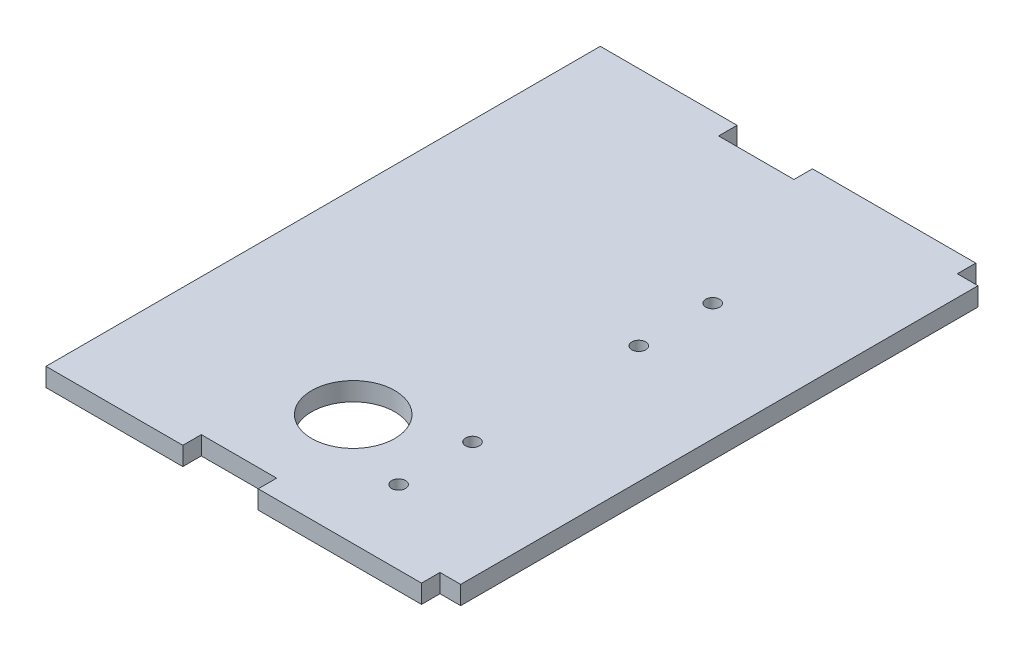
ISO-10303-21;
HEADER;
FILE_DESCRIPTION(('STEP AP214'),'2;1');
FILE_NAME('part.step','',(''),(''),'','','');
FILE_SCHEMA(('AUTOMOTIVE_DESIGN { 1 0 10303 214 1 1 1 1 }'));
ENDSEC;
DATA;
#1=APPLICATION_CONTEXT('core data for automotive mechanical design processes');
#2=APPLICATION_PROTOCOL_DEFINITION('international standard','automotive_design',2000,#1);
#3=PRODUCT_CONTEXT('',#1,'mechanical');
#4=PRODUCT('Part','Part','',(#3));
#5=PRODUCT_RELATED_PRODUCT_CATEGORY('part','',(#4));
#6=PRODUCT_DEFINITION_FORMATION('','',#4);
#7=PRODUCT_DEFINITION_CONTEXT('part definition',#1,'design');
#8=PRODUCT_DEFINITION('design','',#6,#7);
#9=PRODUCT_DEFINITION_SHAPE('','',#8);
#10=(LENGTH_UNIT() NAMED_UNIT(*) SI_UNIT(.MILLI.,.METRE.));
#11=(NAMED_UNIT(*) PLANE_ANGLE_UNIT() SI_UNIT($,.RADIAN.));
#12=(NAMED_UNIT(*) SI_UNIT($,.STERADIAN.) SOLID_ANGLE_UNIT());
#13=UNCERTAINTY_MEASURE_WITH_UNIT(LENGTH_MEASURE(1.E-05),#10,'distance_accuracy_value','');
#14=(GEOMETRIC_REPRESENTATION_CONTEXT(3) GLOBAL_UNCERTAINTY_ASSIGNED_CONTEXT((#13)) GLOBAL_UNIT_ASSIGNED_CONTEXT((#10,
#11,#12)) REPRESENTATION_CONTEXT('',''));
#15=CARTESIAN_POINT('',(0.,0.,0.));
#16=DIRECTION('',(0.,0.,1.));
#17=DIRECTION('',(1.,0.,0.));
#18=AXIS2_PLACEMENT_3D('',#15,#16,#17);
#19=CARTESIAN_POINT('',(0.,12.7,0.));
#20=DIRECTION('',(0.,0.,-1.));
#21=DIRECTION('',(-1.,0.,0.));
#22=AXIS2_PLACEMENT_3D('',#19,#20,#21);
#23=PLANE('',#22);
#24=DIRECTION('',(0.,1.,0.));
#25=VECTOR('',#24,1.);
#26=CARTESIAN_POINT('',(290.576,0.,0.));
#27=LINE('',#26,#25);
#28=CARTESIAN_POINT('',(290.576,0.,0.));
#29=VERTEX_POINT('',#28);
#30=CARTESIAN_POINT('',(290.576,12.7,0.));
#31=VERTEX_POINT('',#30);
#32=EDGE_CURVE('E270',#29,#31,#27,.T.);
#33=ORIENTED_EDGE('',*,*,#32,.F.);
#34=DIRECTION('',(1.,0.,0.));
#35=VECTOR('',#34,1.);
#36=CARTESIAN_POINT('',(0.,0.,0.));
#37=LINE('',#36,#35);
#38=CARTESIAN_POINT('',(304.8,0.,0.));
#39=VERTEX_POINT('',#38);
#40=EDGE_CURVE('E234',#29,#39,#37,.T.);
#41=ORIENTED_EDGE('',*,*,#40,.T.);
#42=DIRECTION('',(0.,-1.,0.));
#43=VECTOR('',#42,1.);
#44=CARTESIAN_POINT('',(304.8,12.7,0.));
#45=LINE('',#44,#43);
#46=CARTESIAN_POINT('',(304.8,12.7,0.));
#47=VERTEX_POINT('',#46);
#48=EDGE_CURVE('E11',#47,#39,#45,.T.);
#49=ORIENTED_EDGE('',*,*,#48,.F.);
#50=DIRECTION('',(1.,0.,0.));
#51=VECTOR('',#50,1.);
#52=CARTESIAN_POINT('',(0.,12.7,0.));
#53=LINE('',#52,#51);
#54=EDGE_CURVE('E273',#31,#47,#53,.T.);
#55=ORIENTED_EDGE('',*,*,#54,.F.);
#56=EDGE_LOOP('',(#33,#41,#49,#55));
#57=FACE_BOUND('',#56,.T.);
#58=ADVANCED_FACE('F43',(#57),#23,.F.);
#59=CARTESIAN_POINT('',(0.,12.7,-355.6));
#60=DIRECTION('',(0.,0.,1.));
#61=DIRECTION('',(1.,0.,0.));
#62=AXIS2_PLACEMENT_3D('',#59,#60,#61);
#63=PLANE('',#62);
#64=DIRECTION('',(-1.,0.,0.));
#65=VECTOR('',#64,1.);
#66=CARTESIAN_POINT('',(0.,0.,-355.6));
#67=LINE('',#66,#65);
#68=CARTESIAN_POINT('',(304.8,0.,-355.6));
#69=VERTEX_POINT('',#68);
#70=CARTESIAN_POINT('',(290.576,0.,-355.6));
#71=VERTEX_POINT('',#70);
#72=EDGE_CURVE('E299',#69,#71,#67,.T.);
#73=ORIENTED_EDGE('',*,*,#72,.T.);
#74=DIRECTION('',(0.,1.,0.));
#75=VECTOR('',#74,1.);
#76=CARTESIAN_POINT('',(290.576,0.,-355.6));
#77=LINE('',#76,#75);
#78=CARTESIAN_POINT('',(290.576,12.7,-355.6));
#79=VERTEX_POINT('',#78);
#80=EDGE_CURVE('E324',#71,#79,#77,.T.);
#81=ORIENTED_EDGE('',*,*,#80,.T.);
#82=DIRECTION('',(-1.,0.,0.));
#83=VECTOR('',#82,1.);
#84=CARTESIAN_POINT('',(0.,12.7,-355.6));
#85=LINE('',#84,#83);
#86=CARTESIAN_POINT('',(304.8,12.7,-355.6));
#87=VERTEX_POINT('',#86);
#88=EDGE_CURVE('E294',#87,#79,#85,.T.);
#89=ORIENTED_EDGE('',*,*,#88,.F.);
#90=DIRECTION('',(0.,-1.,0.));
#91=VECTOR('',#90,1.);
#92=CARTESIAN_POINT('',(304.8,12.7,-355.6));
#93=LINE('',#92,#91);
#94=EDGE_CURVE('E52',#87,#69,#93,.T.);
#95=ORIENTED_EDGE('',*,*,#94,.T.);
#96=EDGE_LOOP('',(#73,#81,#89,#95));
#97=FACE_BOUND('',#96,.T.);
#98=ADVANCED_FACE('F248',(#97),#63,.F.);
#99=CARTESIAN_POINT('',(0.,12.7,0.));
#100=DIRECTION('',(0.,-1.,0.));
#101=DIRECTION('',(0.,0.,-1.));
#102=AXIS2_PLACEMENT_3D('',#99,#100,#101);
#103=PLANE('',#102);
#104=CARTESIAN_POINT('',(224.028,12.7,-38.1));
#105=DIRECTION('',(0.,-1.,0.));
#106=DIRECTION('',(0.,0.,-1.));
#107=AXIS2_PLACEMENT_3D('',#104,#105,#106);
#108=CIRCLE('',#107,4.76250000000001);
#109=CARTESIAN_POINT('',(224.028,12.7,-42.8625));
#110=VERTEX_POINT('',#109);
#111=EDGE_CURVE('E197',#110,#110,#108,.T.);
#112=ORIENTED_EDGE('',*,*,#111,.T.);
#113=EDGE_LOOP('',(#112));
#114=FACE_BOUND('',#113,.T.);
#115=CARTESIAN_POINT('',(224.028,12.7,-88.9));
#116=DIRECTION('',(0.,-1.,0.));
#117=DIRECTION('',(0.,0.,-1.));
#118=AXIS2_PLACEMENT_3D('',#115,#116,#117);
#119=CIRCLE('',#118,4.76250000000001);
#120=CARTESIAN_POINT('',(224.028,12.7,-93.6625));
#121=VERTEX_POINT('',#120);
#122=EDGE_CURVE('E210',#121,#121,#119,.T.);
#123=ORIENTED_EDGE('',*,*,#122,.T.);
#124=EDGE_LOOP('',(#123));
#125=FACE_BOUND('',#124,.T.);
#126=CARTESIAN_POINT('',(224.028,12.7,-203.2));
#127=DIRECTION('',(0.,-1.,0.));
#128=DIRECTION('',(0.,0.,-1.));
#129=AXIS2_PLACEMENT_3D('',#126,#127,#128);
#130=CIRCLE('',#129,4.76250000000001);
#131=CARTESIAN_POINT('',(224.028,12.7,-207.9625));
#132=VERTEX_POINT('',#131);
#133=EDGE_CURVE('E218',#132,#132,#130,.T.);
#134=ORIENTED_EDGE('',*,*,#133,.T.);
#135=EDGE_LOOP('',(#134));
#136=FACE_BOUND('',#135,.T.);
#137=CARTESIAN_POINT('',(224.028,12.7,-254.));
#138=DIRECTION('',(0.,-1.,0.));
#139=DIRECTION('',(0.,0.,-1.));
#140=AXIS2_PLACEMENT_3D('',#137,#138,#139);
#141=CIRCLE('',#140,4.76250000000001);
#142=CARTESIAN_POINT('',(224.028,12.7,-258.7625));
#143=VERTEX_POINT('',#142);
#144=EDGE_CURVE('E192',#143,#143,#141,.T.);
#145=ORIENTED_EDGE('',*,*,#144,.T.);
#146=EDGE_LOOP('',(#145));
#147=FACE_BOUND('',#146,.T.);
#148=DIRECTION('',(-1.,0.,0.));
#149=VECTOR('',#148,1.);
#150=CARTESIAN_POINT('',(14.224,12.7,-368.3));
#151=LINE('',#150,#149);
#152=CARTESIAN_POINT('',(126.492,12.7,-368.3));
#153=VERTEX_POINT('',#152);
#154=CARTESIAN_POINT('',(32.4508751450575,12.7,-368.3));
#155=VERTEX_POINT('',#154);
#156=EDGE_CURVE('E168',#153,#155,#151,.T.);
#157=ORIENTED_EDGE('',*,*,#156,.T.);
#158=DIRECTION('',(0.,0.,1.));
#159=VECTOR('',#158,1.);
#160=CARTESIAN_POINT('',(32.4508751450575,12.7,-368.3));
#161=LINE('',#160,#159);
#162=CARTESIAN_POINT('',(32.4508751450575,12.7,12.7));
#163=VERTEX_POINT('',#162);
#164=EDGE_CURVE('E155',#155,#163,#161,.T.);
#165=ORIENTED_EDGE('',*,*,#164,.T.);
#166=DIRECTION('',(1.,0.,0.));
#167=VECTOR('',#166,1.);
#168=CARTESIAN_POINT('',(14.2240000000001,12.7,12.7));
#169=LINE('',#168,#167);
#170=CARTESIAN_POINT('',(126.492,12.7,12.6999999999999));
#171=VERTEX_POINT('',#170);
#172=EDGE_CURVE('E279',#163,#171,#169,.T.);
#173=ORIENTED_EDGE('',*,*,#172,.T.);
#174=DIRECTION('',(0.,0.,-1.));
#175=VECTOR('',#174,1.);
#176=CARTESIAN_POINT('',(126.492,12.7,0.));
#177=LINE('',#176,#175);
#178=CARTESIAN_POINT('',(126.492,12.7,0.));
#179=VERTEX_POINT('',#178);
#180=EDGE_CURVE('E67',#171,#179,#177,.T.);
#181=ORIENTED_EDGE('',*,*,#180,.T.);
#182=CARTESIAN_POINT('',(178.308,12.7,0.));
#183=VERTEX_POINT('',#182);
#184=EDGE_CURVE('E314',#179,#183,#53,.T.);
#185=ORIENTED_EDGE('',*,*,#184,.T.);
#186=DIRECTION('',(0.,0.,1.));
#187=VECTOR('',#186,1.);
#188=CARTESIAN_POINT('',(178.308,12.7,0.));
#189=LINE('',#188,#187);
#190=CARTESIAN_POINT('',(178.308,12.7,12.6999999999999));
#191=VERTEX_POINT('',#190);
#192=EDGE_CURVE('E330',#183,#191,#189,.T.);
#193=ORIENTED_EDGE('',*,*,#192,.T.);
#194=DIRECTION('',(1.,0.,0.));
#195=VECTOR('',#194,1.);
#196=CARTESIAN_POINT('',(290.576,12.7,12.7));
#197=LINE('',#196,#195);
#198=CARTESIAN_POINT('',(290.576,12.7,12.7));
#199=VERTEX_POINT('',#198);
#200=EDGE_CURVE('E337',#191,#199,#197,.T.);
#201=ORIENTED_EDGE('',*,*,#200,.T.);
#202=DIRECTION('',(0.,0.,-1.));
#203=VECTOR('',#202,1.);
#204=CARTESIAN_POINT('',(290.576,12.7,0.));
#205=LINE('',#204,#203);
#206=EDGE_CURVE('E322',#199,#31,#205,.T.);
#207=ORIENTED_EDGE('',*,*,#206,.T.);
#208=ORIENTED_EDGE('',*,*,#54,.T.);
#209=DIRECTION('',(0.,0.,-1.));
#210=VECTOR('',#209,1.);
#211=CARTESIAN_POINT('',(304.8,12.7,0.));
#212=LINE('',#211,#210);
#213=EDGE_CURVE('E311',#47,#87,#212,.T.);
#214=ORIENTED_EDGE('',*,*,#213,.T.);
#215=ORIENTED_EDGE('',*,*,#88,.T.);
#216=DIRECTION('',(0.,0.,-1.));
#217=VECTOR('',#216,1.);
#218=CARTESIAN_POINT('',(290.576,12.7,-355.6));
#219=LINE('',#218,#217);
#220=CARTESIAN_POINT('',(290.576,12.7,-368.3));
#221=VERTEX_POINT('',#220);
#222=EDGE_CURVE('E185',#79,#221,#219,.T.);
#223=ORIENTED_EDGE('',*,*,#222,.T.);
#224=DIRECTION('',(-1.,0.,0.));
#225=VECTOR('',#224,1.);
#226=CARTESIAN_POINT('',(290.576,12.7,-368.3));
#227=LINE('',#226,#225);
#228=CARTESIAN_POINT('',(178.308,12.7,-368.3));
#229=VERTEX_POINT('',#228);
#230=EDGE_CURVE('E344',#221,#229,#227,.T.);
#231=ORIENTED_EDGE('',*,*,#230,.T.);
#232=DIRECTION('',(0.,0.,1.));
#233=VECTOR('',#232,1.);
#234=CARTESIAN_POINT('',(178.308,12.7,-355.6));
#235=LINE('',#234,#233);
#236=CARTESIAN_POINT('',(178.308,12.7,-355.6));
#237=VERTEX_POINT('',#236);
#238=EDGE_CURVE('E341',#229,#237,#235,.T.);
#239=ORIENTED_EDGE('',*,*,#238,.T.);
#240=CARTESIAN_POINT('',(126.492,12.7,-355.6));
#241=VERTEX_POINT('',#240);
#242=EDGE_CURVE('E308',#237,#241,#85,.T.);
#243=ORIENTED_EDGE('',*,*,#242,.T.);
#244=DIRECTION('',(0.,0.,-1.));
#245=VECTOR('',#244,1.);
#246=CARTESIAN_POINT('',(126.492,12.7,-355.6));
#247=LINE('',#246,#245);
#248=EDGE_CURVE('E177',#241,#153,#247,.T.);
#249=ORIENTED_EDGE('',*,*,#248,.T.);
#250=EDGE_LOOP('',(#157,#165,#173,#181,#185,#193,#201,#207,#208,#214,#215,#223,#231,#239,#243,#249));
#251=FACE_BOUND('',#250,.T.);
#252=CARTESIAN_POINT('',(166.724174941641,12.7,-64.1950036756181));
#253=DIRECTION('',(0.,1.,0.));
#254=DIRECTION('',(1.,0.,0.));
#255=AXIS2_PLACEMENT_3D('',#252,#253,#254);
#256=ELLIPSE('',#255,28.575,28.5739911525185);
#257=CARTESIAN_POINT('',(195.299174941641,12.7,-64.1950036756185));
#258=VERTEX_POINT('',#257);
#259=EDGE_CURVE('E229',#258,#258,#256,.T.);
#260=ORIENTED_EDGE('',*,*,#259,.F.);
#261=EDGE_LOOP('',(#260));
#262=FACE_BOUND('',#261,.T.);
#263=ADVANCED_FACE('F174',(#114,#125,#136,#147,#251,#262),#103,.F.);
#264=CARTESIAN_POINT('',(0.,0.,0.));
#265=DIRECTION('',(0.,-1.,0.));
#266=DIRECTION('',(0.,0.,-1.));
#267=AXIS2_PLACEMENT_3D('',#264,#265,#266);
#268=PLANE('',#267);
#269=DIRECTION('',(0.,0.,1.));
#270=VECTOR('',#269,1.);
#271=CARTESIAN_POINT('',(32.4508751450575,0.,-368.3));
#272=LINE('',#271,#270);
#273=CARTESIAN_POINT('',(32.4508751450575,0.,-368.3));
#274=VERTEX_POINT('',#273);
#275=CARTESIAN_POINT('',(32.4508751450575,0.,12.7));
#276=VERTEX_POINT('',#275);
#277=EDGE_CURVE('E59',#274,#276,#272,.T.);
#278=ORIENTED_EDGE('',*,*,#277,.F.);
#279=DIRECTION('',(-1.,0.,0.));
#280=VECTOR('',#279,1.);
#281=CARTESIAN_POINT('',(14.224,0.,-368.3));
#282=LINE('',#281,#280);
#283=CARTESIAN_POINT('',(126.492,0.,-368.3));
#284=VERTEX_POINT('',#283);
#285=EDGE_CURVE('E170',#284,#274,#282,.T.);
#286=ORIENTED_EDGE('',*,*,#285,.F.);
#287=DIRECTION('',(0.,0.,-1.));
#288=VECTOR('',#287,1.);
#289=CARTESIAN_POINT('',(126.492,0.,-355.6));
#290=LINE('',#289,#288);
#291=CARTESIAN_POINT('',(126.492,0.,-355.6));
#292=VERTEX_POINT('',#291);
#293=EDGE_CURVE('E179',#292,#284,#290,.T.);
#294=ORIENTED_EDGE('',*,*,#293,.F.);
#295=CARTESIAN_POINT('',(178.308,0.,-355.6));
#296=VERTEX_POINT('',#295);
#297=EDGE_CURVE('E298',#296,#292,#67,.T.);
#298=ORIENTED_EDGE('',*,*,#297,.F.);
#299=DIRECTION('',(0.,0.,1.));
#300=VECTOR('',#299,1.);
#301=CARTESIAN_POINT('',(178.308,0.,-355.6));
#302=LINE('',#301,#300);
#303=CARTESIAN_POINT('',(178.308,0.,-368.3));
#304=VERTEX_POINT('',#303);
#305=EDGE_CURVE('E351',#304,#296,#302,.T.);
#306=ORIENTED_EDGE('',*,*,#305,.F.);
#307=DIRECTION('',(-1.,0.,0.));
#308=VECTOR('',#307,1.);
#309=CARTESIAN_POINT('',(290.576,0.,-368.3));
#310=LINE('',#309,#308);
#311=CARTESIAN_POINT('',(290.576,0.,-368.3));
#312=VERTEX_POINT('',#311);
#313=EDGE_CURVE('E354',#312,#304,#310,.T.);
#314=ORIENTED_EDGE('',*,*,#313,.F.);
#315=DIRECTION('',(0.,0.,-1.));
#316=VECTOR('',#315,1.);
#317=CARTESIAN_POINT('',(290.576,0.,-355.6));
#318=LINE('',#317,#316);
#319=EDGE_CURVE('E345',#71,#312,#318,.T.);
#320=ORIENTED_EDGE('',*,*,#319,.F.);
#321=ORIENTED_EDGE('',*,*,#72,.F.);
#322=DIRECTION('',(0.,0.,-1.));
#323=VECTOR('',#322,1.);
#324=CARTESIAN_POINT('',(304.8,0.,0.));
#325=LINE('',#324,#323);
#326=EDGE_CURVE('E287',#39,#69,#325,.T.);
#327=ORIENTED_EDGE('',*,*,#326,.F.);
#328=ORIENTED_EDGE('',*,*,#40,.F.);
#329=DIRECTION('',(0.,0.,-1.));
#330=VECTOR('',#329,1.);
#331=CARTESIAN_POINT('',(290.576,0.,0.));
#332=LINE('',#331,#330);
#333=CARTESIAN_POINT('',(290.576,0.,12.7));
#334=VERTEX_POINT('',#333);
#335=EDGE_CURVE('E285',#334,#29,#332,.T.);
#336=ORIENTED_EDGE('',*,*,#335,.F.);
#337=DIRECTION('',(1.,0.,0.));
#338=VECTOR('',#337,1.);
#339=CARTESIAN_POINT('',(290.576,0.,12.7));
#340=LINE('',#339,#338);
#341=CARTESIAN_POINT('',(178.308,0.,12.6999999999999));
#342=VERTEX_POINT('',#341);
#343=EDGE_CURVE('E382',#342,#334,#340,.T.);
#344=ORIENTED_EDGE('',*,*,#343,.F.);
#345=DIRECTION('',(0.,0.,1.));
#346=VECTOR('',#345,1.);
#347=CARTESIAN_POINT('',(178.308,0.,0.));
#348=LINE('',#347,#346);
#349=CARTESIAN_POINT('',(178.308,0.,0.));
#350=VERTEX_POINT('',#349);
#351=EDGE_CURVE('E378',#350,#342,#348,.T.);
#352=ORIENTED_EDGE('',*,*,#351,.F.);
#353=CARTESIAN_POINT('',(126.492,0.,0.));
#354=VERTEX_POINT('',#353);
#355=EDGE_CURVE('E289',#354,#350,#37,.T.);
#356=ORIENTED_EDGE('',*,*,#355,.F.);
#357=DIRECTION('',(0.,0.,-1.));
#358=VECTOR('',#357,1.);
#359=CARTESIAN_POINT('',(126.492,0.,0.));
#360=LINE('',#359,#358);
#361=CARTESIAN_POINT('',(126.492,0.,12.6999999999999));
#362=VERTEX_POINT('',#361);
#363=EDGE_CURVE('E404',#362,#354,#360,.T.);
#364=ORIENTED_EDGE('',*,*,#363,.F.);
#365=DIRECTION('',(1.,0.,0.));
#366=VECTOR('',#365,1.);
#367=CARTESIAN_POINT('',(14.2240000000001,0.,12.7));
#368=LINE('',#367,#366);
#369=EDGE_CURVE('E401',#276,#362,#368,.T.);
#370=ORIENTED_EDGE('',*,*,#369,.F.);
#371=EDGE_LOOP('',(#278,#286,#294,#298,#306,#314,#320,#321,#327,#328,#336,#344,#352,#356,#364,#370));
#372=FACE_BOUND('',#371,.T.);
#373=CARTESIAN_POINT('',(224.028,0.,-38.1));
#374=DIRECTION('',(0.,-1.,0.));
#375=DIRECTION('',(0.,0.,-1.));
#376=AXIS2_PLACEMENT_3D('',#373,#374,#375);
#377=CIRCLE('',#376,4.76250000000001);
#378=CARTESIAN_POINT('',(224.028,0.,-42.8625));
#379=VERTEX_POINT('',#378);
#380=EDGE_CURVE('E202',#379,#379,#377,.T.);
#381=ORIENTED_EDGE('',*,*,#380,.F.);
#382=EDGE_LOOP('',(#381));
#383=FACE_BOUND('',#382,.T.);
#384=CARTESIAN_POINT('',(224.028,0.,-88.9));
#385=DIRECTION('',(0.,-1.,0.));
#386=DIRECTION('',(0.,0.,-1.));
#387=AXIS2_PLACEMENT_3D('',#384,#385,#386);
#388=CIRCLE('',#387,4.76250000000001);
#389=CARTESIAN_POINT('',(224.028,0.,-93.6625));
#390=VERTEX_POINT('',#389);
#391=EDGE_CURVE('E206',#390,#390,#388,.T.);
#392=ORIENTED_EDGE('',*,*,#391,.F.);
#393=EDGE_LOOP('',(#392));
#394=FACE_BOUND('',#393,.T.);
#395=CARTESIAN_POINT('',(224.028,0.,-203.2));
#396=DIRECTION('',(0.,-1.,0.));
#397=DIRECTION('',(0.,0.,-1.));
#398=AXIS2_PLACEMENT_3D('',#395,#396,#397);
#399=CIRCLE('',#398,4.76250000000001);
#400=CARTESIAN_POINT('',(224.028,0.,-207.9625));
#401=VERTEX_POINT('',#400);
#402=EDGE_CURVE('E214',#401,#401,#399,.T.);
#403=ORIENTED_EDGE('',*,*,#402,.F.);
#404=EDGE_LOOP('',(#403));
#405=FACE_BOUND('',#404,.T.);
#406=CARTESIAN_POINT('',(224.028,0.,-254.));
#407=DIRECTION('',(0.,-1.,0.));
#408=DIRECTION('',(0.,0.,-1.));
#409=AXIS2_PLACEMENT_3D('',#406,#407,#408);
#410=CIRCLE('',#409,4.76250000000001);
#411=CARTESIAN_POINT('',(224.028,0.,-258.7625));
#412=VERTEX_POINT('',#411);
#413=EDGE_CURVE('E222',#412,#412,#410,.T.);
#414=ORIENTED_EDGE('',*,*,#413,.F.);
#415=EDGE_LOOP('',(#414));
#416=FACE_BOUND('',#415,.T.);
#417=CARTESIAN_POINT('',(166.724174941641,0.,-64.1950036756181));
#418=DIRECTION('',(0.,1.,0.));
#419=DIRECTION('',(1.,0.,0.));
#420=AXIS2_PLACEMENT_3D('',#417,#418,#419);
#421=ELLIPSE('',#420,28.575,28.5739911525185);
#422=CARTESIAN_POINT('',(195.299174941641,0.,-64.1950036756185));
#423=VERTEX_POINT('',#422);
#424=EDGE_CURVE('E201',#423,#423,#421,.T.);
#425=ORIENTED_EDGE('',*,*,#424,.T.);
#426=EDGE_LOOP('',(#425));
#427=FACE_BOUND('',#426,.T.);
#428=ADVANCED_FACE('F247',(#372,#383,#394,#405,#416,#427),#268,.T.);
#429=ORIENTED_EDGE('',*,*,#184,.F.);
#430=DIRECTION('',(0.,1.,0.));
#431=VECTOR('',#430,1.);
#432=CARTESIAN_POINT('',(126.492,0.,0.));
#433=LINE('',#432,#431);
#434=EDGE_CURVE('E412',#354,#179,#433,.T.);
#435=ORIENTED_EDGE('',*,*,#434,.F.);
#436=ORIENTED_EDGE('',*,*,#355,.T.);
#437=DIRECTION('',(0.,1.,0.));
#438=VECTOR('',#437,1.);
#439=CARTESIAN_POINT('',(178.308,0.,0.));
#440=LINE('',#439,#438);
#441=EDGE_CURVE('E387',#350,#183,#440,.T.);
#442=ORIENTED_EDGE('',*,*,#441,.T.);
#443=EDGE_LOOP('',(#429,#435,#436,#442));
#444=FACE_BOUND('',#443,.T.);
#445=ADVANCED_FACE('F45',(#444),#23,.F.);
#446=CARTESIAN_POINT('',(304.8,12.7,0.));
#447=DIRECTION('',(-1.,0.,0.));
#448=DIRECTION('',(0.,0.,1.));
#449=AXIS2_PLACEMENT_3D('',#446,#447,#448);
#450=PLANE('',#449);
#451=ORIENTED_EDGE('',*,*,#326,.T.);
#452=ORIENTED_EDGE('',*,*,#94,.F.);
#453=ORIENTED_EDGE('',*,*,#213,.F.);
#454=ORIENTED_EDGE('',*,*,#48,.T.);
#455=EDGE_LOOP('',(#451,#452,#453,#454));
#456=FACE_BOUND('',#455,.T.);
#457=ADVANCED_FACE('F254',(#456),#450,.F.);
#458=ORIENTED_EDGE('',*,*,#242,.F.);
#459=DIRECTION('',(0.,1.,0.));
#460=VECTOR('',#459,1.);
#461=CARTESIAN_POINT('',(178.308,0.,-355.6));
#462=LINE('',#461,#460);
#463=EDGE_CURVE('E329',#296,#237,#462,.T.);
#464=ORIENTED_EDGE('',*,*,#463,.F.);
#465=ORIENTED_EDGE('',*,*,#297,.T.);
#466=DIRECTION('',(0.,1.,0.));
#467=VECTOR('',#466,1.);
#468=CARTESIAN_POINT('',(126.492,0.,-355.6));
#469=LINE('',#468,#467);
#470=EDGE_CURVE('E193',#292,#241,#469,.T.);
#471=ORIENTED_EDGE('',*,*,#470,.T.);
#472=EDGE_LOOP('',(#458,#464,#465,#471));
#473=FACE_BOUND('',#472,.T.);
#474=ADVANCED_FACE('F242',(#473),#63,.F.);
#475=DIRECTION('',(0.,-1.,0.));
#476=VECTOR('',#475,1.);
#477=SURFACE_OF_LINEAR_EXTRUSION('',#256,#476);
#478=ORIENTED_EDGE('',*,*,#259,.T.);
#479=EDGE_LOOP('',(#478));
#480=FACE_BOUND('',#479,.T.);
#481=ORIENTED_EDGE('',*,*,#424,.F.);
#482=EDGE_LOOP('',(#481));
#483=FACE_BOUND('',#482,.T.);
#484=ADVANCED_FACE('F237',(#480,#483),#477,.T.);
#485=CARTESIAN_POINT('',(224.028,12.7,-254.));
#486=DIRECTION('',(0.,-1.,0.));
#487=DIRECTION('',(0.,0.,-1.));
#488=AXIS2_PLACEMENT_3D('',#485,#486,#487);
#489=CYLINDRICAL_SURFACE('',#488,4.76250000000001);
#490=ORIENTED_EDGE('',*,*,#144,.F.);
#491=EDGE_LOOP('',(#490));
#492=FACE_BOUND('',#491,.T.);
#493=ORIENTED_EDGE('',*,*,#413,.T.);
#494=EDGE_LOOP('',(#493));
#495=FACE_BOUND('',#494,.T.);
#496=ADVANCED_FACE('F241',(#492,#495),#489,.F.);
#497=CARTESIAN_POINT('',(224.028,12.7,-203.2));
#498=DIRECTION('',(0.,-1.,0.));
#499=DIRECTION('',(0.,0.,-1.));
#500=AXIS2_PLACEMENT_3D('',#497,#498,#499);
#501=CYLINDRICAL_SURFACE('',#500,4.76250000000001);
#502=ORIENTED_EDGE('',*,*,#133,.F.);
#503=EDGE_LOOP('',(#502));
#504=FACE_BOUND('',#503,.T.);
#505=ORIENTED_EDGE('',*,*,#402,.T.);
#506=EDGE_LOOP('',(#505));
#507=FACE_BOUND('',#506,.T.);
#508=ADVANCED_FACE('F466',(#504,#507),#501,.F.);
#509=CARTESIAN_POINT('',(224.028,12.7,-88.9));
#510=DIRECTION('',(0.,-1.,0.));
#511=DIRECTION('',(0.,0.,-1.));
#512=AXIS2_PLACEMENT_3D('',#509,#510,#511);
#513=CYLINDRICAL_SURFACE('',#512,4.76250000000001);
#514=ORIENTED_EDGE('',*,*,#122,.F.);
#515=EDGE_LOOP('',(#514));
#516=FACE_BOUND('',#515,.T.);
#517=ORIENTED_EDGE('',*,*,#391,.T.);
#518=EDGE_LOOP('',(#517));
#519=FACE_BOUND('',#518,.T.);
#520=ADVANCED_FACE('F463',(#516,#519),#513,.F.);
#521=CARTESIAN_POINT('',(224.028,12.7,-38.1));
#522=DIRECTION('',(0.,-1.,0.));
#523=DIRECTION('',(0.,0.,-1.));
#524=AXIS2_PLACEMENT_3D('',#521,#522,#523);
#525=CYLINDRICAL_SURFACE('',#524,4.76250000000001);
#526=ORIENTED_EDGE('',*,*,#111,.F.);
#527=EDGE_LOOP('',(#526));
#528=FACE_BOUND('',#527,.T.);
#529=ORIENTED_EDGE('',*,*,#380,.T.);
#530=EDGE_LOOP('',(#529));
#531=FACE_BOUND('',#530,.T.);
#532=ADVANCED_FACE('F457',(#528,#531),#525,.F.);
#533=CARTESIAN_POINT('',(14.224,0.,-368.3));
#534=DIRECTION('',(0.,0.,-1.));
#535=DIRECTION('',(-1.,0.,0.));
#536=AXIS2_PLACEMENT_3D('',#533,#534,#535);
#537=PLANE('',#536);
#538=DIRECTION('',(0.,-1.,0.));
#539=VECTOR('',#538,1.);
#540=CARTESIAN_POINT('',(32.4508751450575,12.7,-368.3));
#541=LINE('',#540,#539);
#542=EDGE_CURVE('E158',#155,#274,#541,.T.);
#543=ORIENTED_EDGE('',*,*,#542,.F.);
#544=ORIENTED_EDGE('',*,*,#156,.F.);
#545=DIRECTION('',(0.,1.,0.));
#546=VECTOR('',#545,1.);
#547=CARTESIAN_POINT('',(126.492,0.,-368.3));
#548=LINE('',#547,#546);
#549=EDGE_CURVE('E189',#284,#153,#548,.T.);
#550=ORIENTED_EDGE('',*,*,#549,.F.);
#551=ORIENTED_EDGE('',*,*,#285,.T.);
#552=EDGE_LOOP('',(#543,#544,#550,#551));
#553=FACE_BOUND('',#552,.T.);
#554=ADVANCED_FACE('F167',(#553),#537,.T.);
#555=CARTESIAN_POINT('',(126.492,0.,-355.6));
#556=DIRECTION('',(1.,0.,0.));
#557=DIRECTION('',(0.,0.,-1.));
#558=AXIS2_PLACEMENT_3D('',#555,#556,#557);
#559=PLANE('',#558);
#560=ORIENTED_EDGE('',*,*,#248,.F.);
#561=ORIENTED_EDGE('',*,*,#470,.F.);
#562=ORIENTED_EDGE('',*,*,#293,.T.);
#563=ORIENTED_EDGE('',*,*,#549,.T.);
#564=EDGE_LOOP('',(#560,#561,#562,#563));
#565=FACE_BOUND('',#564,.T.);
#566=ADVANCED_FACE('F450',(#565),#559,.T.);
#567=CARTESIAN_POINT('',(290.576,0.,-355.6));
#568=DIRECTION('',(1.,0.,0.));
#569=DIRECTION('',(0.,0.,-1.));
#570=AXIS2_PLACEMENT_3D('',#567,#568,#569);
#571=PLANE('',#570);
#572=ORIENTED_EDGE('',*,*,#222,.F.);
#573=ORIENTED_EDGE('',*,*,#80,.F.);
#574=ORIENTED_EDGE('',*,*,#319,.T.);
#575=DIRECTION('',(0.,1.,0.));
#576=VECTOR('',#575,1.);
#577=CARTESIAN_POINT('',(290.576,0.,-368.3));
#578=LINE('',#577,#576);
#579=EDGE_CURVE('E355',#312,#221,#578,.T.);
#580=ORIENTED_EDGE('',*,*,#579,.T.);
#581=EDGE_LOOP('',(#572,#573,#574,#580));
#582=FACE_BOUND('',#581,.T.);
#583=ADVANCED_FACE('F366',(#582),#571,.T.);
#584=CARTESIAN_POINT('',(178.308,0.,-355.6));
#585=DIRECTION('',(-1.,0.,0.));
#586=DIRECTION('',(0.,0.,1.));
#587=AXIS2_PLACEMENT_3D('',#584,#585,#586);
#588=PLANE('',#587);
#589=ORIENTED_EDGE('',*,*,#238,.F.);
#590=DIRECTION('',(0.,1.,0.));
#591=VECTOR('',#590,1.);
#592=CARTESIAN_POINT('',(178.308,0.,-368.3));
#593=LINE('',#592,#591);
#594=EDGE_CURVE('E335',#304,#229,#593,.T.);
#595=ORIENTED_EDGE('',*,*,#594,.F.);
#596=ORIENTED_EDGE('',*,*,#305,.T.);
#597=ORIENTED_EDGE('',*,*,#463,.T.);
#598=EDGE_LOOP('',(#589,#595,#596,#597));
#599=FACE_BOUND('',#598,.T.);
#600=ADVANCED_FACE('F445',(#599),#588,.T.);
#601=CARTESIAN_POINT('',(290.576,0.,-368.3));
#602=DIRECTION('',(0.,0.,-1.));
#603=DIRECTION('',(-1.,0.,0.));
#604=AXIS2_PLACEMENT_3D('',#601,#602,#603);
#605=PLANE('',#604);
#606=ORIENTED_EDGE('',*,*,#230,.F.);
#607=ORIENTED_EDGE('',*,*,#579,.F.);
#608=ORIENTED_EDGE('',*,*,#313,.T.);
#609=ORIENTED_EDGE('',*,*,#594,.T.);
#610=EDGE_LOOP('',(#606,#607,#608,#609));
#611=FACE_BOUND('',#610,.T.);
#612=ADVANCED_FACE('F372',(#611),#605,.T.);
#613=CARTESIAN_POINT('',(290.576,0.,0.));
#614=DIRECTION('',(1.,0.,0.));
#615=DIRECTION('',(0.,0.,-1.));
#616=AXIS2_PLACEMENT_3D('',#613,#614,#615);
#617=PLANE('',#616);
#618=ORIENTED_EDGE('',*,*,#206,.F.);
#619=DIRECTION('',(0.,1.,0.));
#620=VECTOR('',#619,1.);
#621=CARTESIAN_POINT('',(290.576,0.,12.7));
#622=LINE('',#621,#620);
#623=EDGE_CURVE('E278',#334,#199,#622,.T.);
#624=ORIENTED_EDGE('',*,*,#623,.F.);
#625=ORIENTED_EDGE('',*,*,#335,.T.);
#626=ORIENTED_EDGE('',*,*,#32,.T.);
#627=EDGE_LOOP('',(#618,#624,#625,#626));
#628=FACE_BOUND('',#627,.T.);
#629=ADVANCED_FACE('F437',(#628),#617,.T.);
#630=CARTESIAN_POINT('',(290.576,0.,12.7));
#631=DIRECTION('',(0.,0.,1.));
#632=DIRECTION('',(1.,0.,0.));
#633=AXIS2_PLACEMENT_3D('',#630,#631,#632);
#634=PLANE('',#633);
#635=ORIENTED_EDGE('',*,*,#200,.F.);
#636=DIRECTION('',(0.,1.,0.));
#637=VECTOR('',#636,1.);
#638=CARTESIAN_POINT('',(178.308,0.,12.6999999999999));
#639=LINE('',#638,#637);
#640=EDGE_CURVE('E395',#342,#191,#639,.T.);
#641=ORIENTED_EDGE('',*,*,#640,.F.);
#642=ORIENTED_EDGE('',*,*,#343,.T.);
#643=ORIENTED_EDGE('',*,*,#623,.T.);
#644=EDGE_LOOP('',(#635,#641,#642,#643));
#645=FACE_BOUND('',#644,.T.);
#646=ADVANCED_FACE('F436',(#645),#634,.T.);
#647=CARTESIAN_POINT('',(178.308,0.,0.));
#648=DIRECTION('',(-1.,0.,0.));
#649=DIRECTION('',(0.,0.,1.));
#650=AXIS2_PLACEMENT_3D('',#647,#648,#649);
#651=PLANE('',#650);
#652=ORIENTED_EDGE('',*,*,#192,.F.);
#653=ORIENTED_EDGE('',*,*,#441,.F.);
#654=ORIENTED_EDGE('',*,*,#351,.T.);
#655=ORIENTED_EDGE('',*,*,#640,.T.);
#656=EDGE_LOOP('',(#652,#653,#654,#655));
#657=FACE_BOUND('',#656,.T.);
#658=ADVANCED_FACE('F433',(#657),#651,.T.);
#659=CARTESIAN_POINT('',(126.492,0.,0.));
#660=DIRECTION('',(1.,0.,0.));
#661=DIRECTION('',(0.,0.,-1.));
#662=AXIS2_PLACEMENT_3D('',#659,#660,#661);
#663=PLANE('',#662);
#664=ORIENTED_EDGE('',*,*,#180,.F.);
#665=DIRECTION('',(0.,1.,0.));
#666=VECTOR('',#665,1.);
#667=CARTESIAN_POINT('',(126.492,0.,12.6999999999999));
#668=LINE('',#667,#666);
#669=EDGE_CURVE('E407',#362,#171,#668,.T.);
#670=ORIENTED_EDGE('',*,*,#669,.F.);
#671=ORIENTED_EDGE('',*,*,#363,.T.);
#672=ORIENTED_EDGE('',*,*,#434,.T.);
#673=EDGE_LOOP('',(#664,#670,#671,#672));
#674=FACE_BOUND('',#673,.T.);
#675=ADVANCED_FACE('F430',(#674),#663,.T.);
#676=CARTESIAN_POINT('',(14.2240000000001,0.,12.7));
#677=DIRECTION('',(0.,0.,1.));
#678=DIRECTION('',(1.,0.,0.));
#679=AXIS2_PLACEMENT_3D('',#676,#677,#678);
#680=PLANE('',#679);
#681=DIRECTION('',(0.,-1.,0.));
#682=VECTOR('',#681,1.);
#683=CARTESIAN_POINT('',(32.4508751450575,12.7,12.7));
#684=LINE('',#683,#682);
#685=EDGE_CURVE('E159',#163,#276,#684,.T.);
#686=ORIENTED_EDGE('',*,*,#685,.T.);
#687=ORIENTED_EDGE('',*,*,#369,.T.);
#688=ORIENTED_EDGE('',*,*,#669,.T.);
#689=ORIENTED_EDGE('',*,*,#172,.F.);
#690=EDGE_LOOP('',(#686,#687,#688,#689));
#691=FACE_BOUND('',#690,.T.);
#692=ADVANCED_FACE('F423',(#691),#680,.T.);
#693=CARTESIAN_POINT('',(32.4508751450575,12.7,-368.3));
#694=DIRECTION('',(1.,0.,0.));
#695=DIRECTION('',(0.,0.,-1.));
#696=AXIS2_PLACEMENT_3D('',#693,#694,#695);
#697=PLANE('',#696);
#698=ORIENTED_EDGE('',*,*,#277,.T.);
#699=ORIENTED_EDGE('',*,*,#685,.F.);
#700=ORIENTED_EDGE('',*,*,#164,.F.);
#701=ORIENTED_EDGE('',*,*,#542,.T.);
#702=EDGE_LOOP('',(#698,#699,#700,#701));
#703=FACE_BOUND('',#702,.T.);
#704=ADVANCED_FACE('F157',(#703),#697,.F.);
#705=CLOSED_SHELL('',(#58,#98,#263,#428,#445,#457,#474,#484,#496,#508,#520,#532,#554,#566,#583,
#600,#612,#629,#646,#658,#675,#692,#704));
#706=MANIFOLD_SOLID_BREP('B2',#705);
#707=ADVANCED_BREP_SHAPE_REPRESENTATION('',(#18,#706),#14);
#708=SHAPE_DEFINITION_REPRESENTATION(#9,#707);
ENDSEC;
END-ISO-10303-21;
